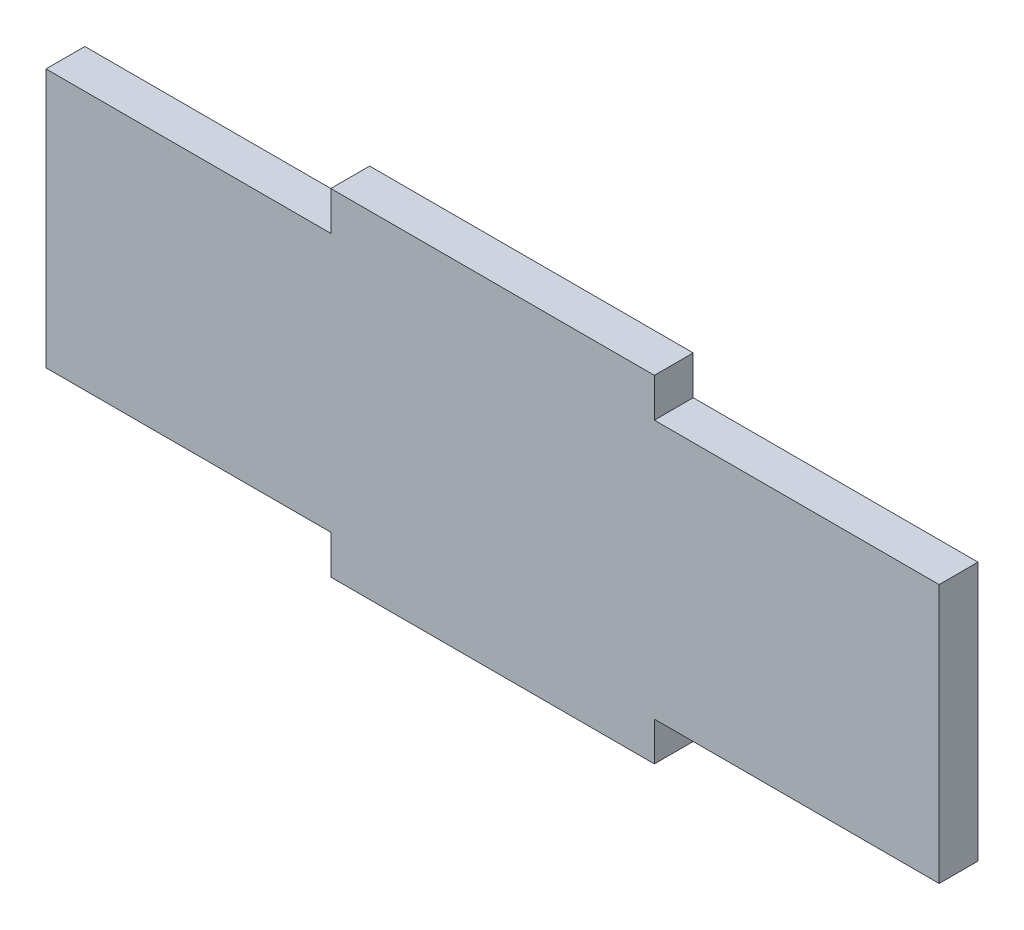
ISO-10303-21;
HEADER;
FILE_DESCRIPTION(('STEP AP214'),'2;1');
FILE_NAME('part.step','',(''),(''),'','','');
FILE_SCHEMA(('AUTOMOTIVE_DESIGN { 1 0 10303 214 1 1 1 1 }'));
ENDSEC;
DATA;
#1=APPLICATION_CONTEXT('core data for automotive mechanical design processes');
#2=APPLICATION_PROTOCOL_DEFINITION('international standard','automotive_design',2000,#1);
#3=PRODUCT_CONTEXT('',#1,'mechanical');
#4=PRODUCT('Part','Part','',(#3));
#5=PRODUCT_RELATED_PRODUCT_CATEGORY('part','',(#4));
#6=PRODUCT_DEFINITION_FORMATION('','',#4);
#7=PRODUCT_DEFINITION_CONTEXT('part definition',#1,'design');
#8=PRODUCT_DEFINITION('design','',#6,#7);
#9=PRODUCT_DEFINITION_SHAPE('','',#8);
#10=(LENGTH_UNIT() NAMED_UNIT(*) SI_UNIT(.MILLI.,.METRE.));
#11=(NAMED_UNIT(*) PLANE_ANGLE_UNIT() SI_UNIT($,.RADIAN.));
#12=(NAMED_UNIT(*) SI_UNIT($,.STERADIAN.) SOLID_ANGLE_UNIT());
#13=UNCERTAINTY_MEASURE_WITH_UNIT(LENGTH_MEASURE(1.E-05),#10,'distance_accuracy_value','');
#14=(GEOMETRIC_REPRESENTATION_CONTEXT(3) GLOBAL_UNCERTAINTY_ASSIGNED_CONTEXT((#13)) GLOBAL_UNIT_ASSIGNED_CONTEXT((#10,
#11,#12)) REPRESENTATION_CONTEXT('',''));
#15=CARTESIAN_POINT('',(0.,0.,0.));
#16=DIRECTION('',(0.,0.,1.));
#17=DIRECTION('',(1.,0.,0.));
#18=AXIS2_PLACEMENT_3D('',#15,#16,#17);
#19=CARTESIAN_POINT('',(69.,-20.,6.));
#20=DIRECTION('',(0.,1.,0.));
#21=DIRECTION('',(-1.,0.,0.));
#22=AXIS2_PLACEMENT_3D('',#19,#20,#21);
#23=PLANE('',#22);
#24=DIRECTION('',(0.,0.,1.));
#25=VECTOR('',#24,1.);
#26=CARTESIAN_POINT('',(25.,-20.,0.));
#27=LINE('',#26,#25);
#28=CARTESIAN_POINT('',(25.,-20.,0.));
#29=VERTEX_POINT('',#28);
#30=CARTESIAN_POINT('',(25.,-20.,6.));
#31=VERTEX_POINT('',#30);
#32=EDGE_CURVE('E154',#29,#31,#27,.T.);
#33=ORIENTED_EDGE('',*,*,#32,.F.);
#34=DIRECTION('',(1.,0.,0.));
#35=VECTOR('',#34,1.);
#36=CARTESIAN_POINT('',(69.,-20.,0.));
#37=LINE('',#36,#35);
#38=CARTESIAN_POINT('',(69.,-20.,0.));
#39=VERTEX_POINT('',#38);
#40=EDGE_CURVE('E197',#29,#39,#37,.T.);
#41=ORIENTED_EDGE('',*,*,#40,.T.);
#42=DIRECTION('',(0.,0.,-1.));
#43=VECTOR('',#42,1.);
#44=CARTESIAN_POINT('',(69.,-20.,6.));
#45=LINE('',#44,#43);
#46=CARTESIAN_POINT('',(69.,-20.,6.));
#47=VERTEX_POINT('',#46);
#48=EDGE_CURVE('E42',#47,#39,#45,.T.);
#49=ORIENTED_EDGE('',*,*,#48,.F.);
#50=DIRECTION('',(1.,0.,0.));
#51=VECTOR('',#50,1.);
#52=CARTESIAN_POINT('',(69.,-20.,6.));
#53=LINE('',#52,#51);
#54=EDGE_CURVE('E183',#31,#47,#53,.T.);
#55=ORIENTED_EDGE('',*,*,#54,.F.);
#56=EDGE_LOOP('',(#33,#41,#49,#55));
#57=FACE_BOUND('',#56,.T.);
#58=ADVANCED_FACE('F34',(#57),#23,.F.);
#59=CARTESIAN_POINT('',(69.,20.,6.));
#60=DIRECTION('',(0.,-1.,0.));
#61=DIRECTION('',(1.,0.,0.));
#62=AXIS2_PLACEMENT_3D('',#59,#60,#61);
#63=PLANE('',#62);
#64=DIRECTION('',(0.,0.,1.));
#65=VECTOR('',#64,1.);
#66=CARTESIAN_POINT('',(-25.,20.,0.));
#67=LINE('',#66,#65);
#68=CARTESIAN_POINT('',(-25.,20.,0.));
#69=VERTEX_POINT('',#68);
#70=CARTESIAN_POINT('',(-25.,20.,6.));
#71=VERTEX_POINT('',#70);
#72=EDGE_CURVE('E166',#69,#71,#67,.T.);
#73=ORIENTED_EDGE('',*,*,#72,.F.);
#74=DIRECTION('',(-1.,0.,0.));
#75=VECTOR('',#74,1.);
#76=CARTESIAN_POINT('',(69.,20.,0.));
#77=LINE('',#76,#75);
#78=CARTESIAN_POINT('',(-69.,20.,0.));
#79=VERTEX_POINT('',#78);
#80=EDGE_CURVE('E202',#69,#79,#77,.T.);
#81=ORIENTED_EDGE('',*,*,#80,.T.);
#82=DIRECTION('',(0.,0.,-1.));
#83=VECTOR('',#82,1.);
#84=CARTESIAN_POINT('',(-69.,20.,6.));
#85=LINE('',#84,#83);
#86=CARTESIAN_POINT('',(-69.,20.,6.));
#87=VERTEX_POINT('',#86);
#88=EDGE_CURVE('E194',#87,#79,#85,.T.);
#89=ORIENTED_EDGE('',*,*,#88,.F.);
#90=DIRECTION('',(-1.,0.,0.));
#91=VECTOR('',#90,1.);
#92=CARTESIAN_POINT('',(69.,20.,6.));
#93=LINE('',#92,#91);
#94=EDGE_CURVE('E190',#71,#87,#93,.T.);
#95=ORIENTED_EDGE('',*,*,#94,.F.);
#96=EDGE_LOOP('',(#73,#81,#89,#95));
#97=FACE_BOUND('',#96,.T.);
#98=ADVANCED_FACE('F242',(#97),#63,.F.);
#99=CARTESIAN_POINT('',(-69.,20.,6.));
#100=DIRECTION('',(1.,0.,0.));
#101=DIRECTION('',(0.,0.,-1.));
#102=AXIS2_PLACEMENT_3D('',#99,#100,#101);
#103=PLANE('',#102);
#104=DIRECTION('',(0.,-1.,0.));
#105=VECTOR('',#104,1.);
#106=CARTESIAN_POINT('',(-69.,20.,0.));
#107=LINE('',#106,#105);
#108=CARTESIAN_POINT('',(-69.,-20.,0.));
#109=VERTEX_POINT('',#108);
#110=EDGE_CURVE('E174',#79,#109,#107,.T.);
#111=ORIENTED_EDGE('',*,*,#110,.T.);
#112=DIRECTION('',(0.,0.,-1.));
#113=VECTOR('',#112,1.);
#114=CARTESIAN_POINT('',(-69.,-20.,6.));
#115=LINE('',#114,#113);
#116=CARTESIAN_POINT('',(-69.,-20.,6.));
#117=VERTEX_POINT('',#116);
#118=EDGE_CURVE('E11',#117,#109,#115,.T.);
#119=ORIENTED_EDGE('',*,*,#118,.F.);
#120=DIRECTION('',(0.,-1.,0.));
#121=VECTOR('',#120,1.);
#122=CARTESIAN_POINT('',(-69.,20.,6.));
#123=LINE('',#122,#121);
#124=EDGE_CURVE('E180',#87,#117,#123,.T.);
#125=ORIENTED_EDGE('',*,*,#124,.F.);
#126=ORIENTED_EDGE('',*,*,#88,.T.);
#127=EDGE_LOOP('',(#111,#119,#125,#126));
#128=FACE_BOUND('',#127,.T.);
#129=ADVANCED_FACE('F36',(#128),#103,.F.);
#130=CARTESIAN_POINT('',(-25.,-20.,0.));
#131=VERTEX_POINT('',#130);
#132=EDGE_CURVE('E198',#109,#131,#37,.T.);
#133=ORIENTED_EDGE('',*,*,#132,.T.);
#134=DIRECTION('',(0.,0.,1.));
#135=VECTOR('',#134,1.);
#136=CARTESIAN_POINT('',(-25.,-20.,0.));
#137=LINE('',#136,#135);
#138=CARTESIAN_POINT('',(-25.,-20.,6.));
#139=VERTEX_POINT('',#138);
#140=EDGE_CURVE('E143',#131,#139,#137,.T.);
#141=ORIENTED_EDGE('',*,*,#140,.T.);
#142=EDGE_CURVE('E185',#117,#139,#53,.T.);
#143=ORIENTED_EDGE('',*,*,#142,.F.);
#144=ORIENTED_EDGE('',*,*,#118,.T.);
#145=EDGE_LOOP('',(#133,#141,#143,#144));
#146=FACE_BOUND('',#145,.T.);
#147=ADVANCED_FACE('F234',(#146),#23,.F.);
#148=CARTESIAN_POINT('',(69.,20.,6.));
#149=DIRECTION('',(-1.,0.,0.));
#150=DIRECTION('',(0.,0.,1.));
#151=AXIS2_PLACEMENT_3D('',#148,#149,#150);
#152=PLANE('',#151);
#153=DIRECTION('',(0.,1.,0.));
#154=VECTOR('',#153,1.);
#155=CARTESIAN_POINT('',(69.,20.,0.));
#156=LINE('',#155,#154);
#157=CARTESIAN_POINT('',(69.,20.,0.));
#158=VERTEX_POINT('',#157);
#159=EDGE_CURVE('E200',#39,#158,#156,.T.);
#160=ORIENTED_EDGE('',*,*,#159,.T.);
#161=DIRECTION('',(0.,0.,-1.));
#162=VECTOR('',#161,1.);
#163=CARTESIAN_POINT('',(69.,20.,6.));
#164=LINE('',#163,#162);
#165=CARTESIAN_POINT('',(69.,20.,6.));
#166=VERTEX_POINT('',#165);
#167=EDGE_CURVE('E207',#166,#158,#164,.T.);
#168=ORIENTED_EDGE('',*,*,#167,.F.);
#169=DIRECTION('',(0.,1.,0.));
#170=VECTOR('',#169,1.);
#171=CARTESIAN_POINT('',(69.,20.,6.));
#172=LINE('',#171,#170);
#173=EDGE_CURVE('E188',#47,#166,#172,.T.);
#174=ORIENTED_EDGE('',*,*,#173,.F.);
#175=ORIENTED_EDGE('',*,*,#48,.T.);
#176=EDGE_LOOP('',(#160,#168,#174,#175));
#177=FACE_BOUND('',#176,.T.);
#178=ADVANCED_FACE('F214',(#177),#152,.F.);
#179=CARTESIAN_POINT('',(25.,20.,0.));
#180=VERTEX_POINT('',#179);
#181=EDGE_CURVE('E184',#158,#180,#77,.T.);
#182=ORIENTED_EDGE('',*,*,#181,.T.);
#183=DIRECTION('',(0.,0.,1.));
#184=VECTOR('',#183,1.);
#185=CARTESIAN_POINT('',(25.,20.,0.));
#186=LINE('',#185,#184);
#187=CARTESIAN_POINT('',(25.,20.,6.));
#188=VERTEX_POINT('',#187);
#189=EDGE_CURVE('E177',#180,#188,#186,.T.);
#190=ORIENTED_EDGE('',*,*,#189,.T.);
#191=EDGE_CURVE('E191',#166,#188,#93,.T.);
#192=ORIENTED_EDGE('',*,*,#191,.F.);
#193=ORIENTED_EDGE('',*,*,#167,.T.);
#194=EDGE_LOOP('',(#182,#190,#192,#193));
#195=FACE_BOUND('',#194,.T.);
#196=ADVANCED_FACE('F222',(#195),#63,.F.);
#197=CARTESIAN_POINT('',(0.,0.,6.));
#198=DIRECTION('',(0.,0.,-1.));
#199=DIRECTION('',(-1.,0.,0.));
#200=AXIS2_PLACEMENT_3D('',#197,#198,#199);
#201=PLANE('',#200);
#202=ORIENTED_EDGE('',*,*,#124,.T.);
#203=ORIENTED_EDGE('',*,*,#142,.T.);
#204=DIRECTION('',(0.,-1.,0.));
#205=VECTOR('',#204,1.);
#206=CARTESIAN_POINT('',(-25.,-20.,6.));
#207=LINE('',#206,#205);
#208=CARTESIAN_POINT('',(-25.,-26.,6.));
#209=VERTEX_POINT('',#208);
#210=EDGE_CURVE('E49',#139,#209,#207,.T.);
#211=ORIENTED_EDGE('',*,*,#210,.T.);
#212=DIRECTION('',(1.,0.,0.));
#213=VECTOR('',#212,1.);
#214=CARTESIAN_POINT('',(-25.,-26.,6.));
#215=LINE('',#214,#213);
#216=CARTESIAN_POINT('',(25.,-26.,6.));
#217=VERTEX_POINT('',#216);
#218=EDGE_CURVE('E128',#209,#217,#215,.T.);
#219=ORIENTED_EDGE('',*,*,#218,.T.);
#220=DIRECTION('',(0.,1.,0.));
#221=VECTOR('',#220,1.);
#222=CARTESIAN_POINT('',(25.,-20.,6.));
#223=LINE('',#222,#221);
#224=EDGE_CURVE('E144',#217,#31,#223,.T.);
#225=ORIENTED_EDGE('',*,*,#224,.T.);
#226=ORIENTED_EDGE('',*,*,#54,.T.);
#227=ORIENTED_EDGE('',*,*,#173,.T.);
#228=ORIENTED_EDGE('',*,*,#191,.T.);
#229=DIRECTION('',(0.,1.,0.));
#230=VECTOR('',#229,1.);
#231=CARTESIAN_POINT('',(25.,20.,6.));
#232=LINE('',#231,#230);
#233=CARTESIAN_POINT('',(25.,26.,6.));
#234=VERTEX_POINT('',#233);
#235=EDGE_CURVE('E57',#188,#234,#232,.T.);
#236=ORIENTED_EDGE('',*,*,#235,.T.);
#237=DIRECTION('',(-1.,0.,0.));
#238=VECTOR('',#237,1.);
#239=CARTESIAN_POINT('',(-25.,26.,6.));
#240=LINE('',#239,#238);
#241=CARTESIAN_POINT('',(-25.,26.,6.));
#242=VERTEX_POINT('',#241);
#243=EDGE_CURVE('E160',#234,#242,#240,.T.);
#244=ORIENTED_EDGE('',*,*,#243,.T.);
#245=DIRECTION('',(0.,-1.,0.));
#246=VECTOR('',#245,1.);
#247=CARTESIAN_POINT('',(-25.,20.,6.));
#248=LINE('',#247,#246);
#249=EDGE_CURVE('E153',#242,#71,#248,.T.);
#250=ORIENTED_EDGE('',*,*,#249,.T.);
#251=ORIENTED_EDGE('',*,*,#94,.T.);
#252=EDGE_LOOP('',(#202,#203,#211,#219,#225,#226,#227,#228,#236,#244,#250,#251));
#253=FACE_BOUND('',#252,.T.);
#254=ADVANCED_FACE('F225',(#253),#201,.F.);
#255=CARTESIAN_POINT('',(0.,0.,0.));
#256=DIRECTION('',(0.,0.,-1.));
#257=DIRECTION('',(-1.,0.,0.));
#258=AXIS2_PLACEMENT_3D('',#255,#256,#257);
#259=PLANE('',#258);
#260=ORIENTED_EDGE('',*,*,#110,.F.);
#261=ORIENTED_EDGE('',*,*,#80,.F.);
#262=DIRECTION('',(0.,-1.,0.));
#263=VECTOR('',#262,1.);
#264=CARTESIAN_POINT('',(-25.,20.,0.));
#265=LINE('',#264,#263);
#266=CARTESIAN_POINT('',(-25.,26.,0.));
#267=VERTEX_POINT('',#266);
#268=EDGE_CURVE('E157',#267,#69,#265,.T.);
#269=ORIENTED_EDGE('',*,*,#268,.F.);
#270=DIRECTION('',(-1.,0.,0.));
#271=VECTOR('',#270,1.);
#272=CARTESIAN_POINT('',(-25.,26.,0.));
#273=LINE('',#272,#271);
#274=CARTESIAN_POINT('',(25.,26.,0.));
#275=VERTEX_POINT('',#274);
#276=EDGE_CURVE('E163',#275,#267,#273,.T.);
#277=ORIENTED_EDGE('',*,*,#276,.F.);
#278=DIRECTION('',(0.,1.,0.));
#279=VECTOR('',#278,1.);
#280=CARTESIAN_POINT('',(25.,20.,0.));
#281=LINE('',#280,#279);
#282=EDGE_CURVE('E159',#180,#275,#281,.T.);
#283=ORIENTED_EDGE('',*,*,#282,.F.);
#284=ORIENTED_EDGE('',*,*,#181,.F.);
#285=ORIENTED_EDGE('',*,*,#159,.F.);
#286=ORIENTED_EDGE('',*,*,#40,.F.);
#287=DIRECTION('',(0.,1.,0.));
#288=VECTOR('',#287,1.);
#289=CARTESIAN_POINT('',(25.,-20.,0.));
#290=LINE('',#289,#288);
#291=CARTESIAN_POINT('',(25.,-26.,0.));
#292=VERTEX_POINT('',#291);
#293=EDGE_CURVE('E131',#292,#29,#290,.T.);
#294=ORIENTED_EDGE('',*,*,#293,.F.);
#295=DIRECTION('',(1.,0.,0.));
#296=VECTOR('',#295,1.);
#297=CARTESIAN_POINT('',(-25.,-26.,0.));
#298=LINE('',#297,#296);
#299=CARTESIAN_POINT('',(-25.,-26.,0.));
#300=VERTEX_POINT('',#299);
#301=EDGE_CURVE('E126',#300,#292,#298,.T.);
#302=ORIENTED_EDGE('',*,*,#301,.F.);
#303=DIRECTION('',(0.,-1.,0.));
#304=VECTOR('',#303,1.);
#305=CARTESIAN_POINT('',(-25.,-20.,0.));
#306=LINE('',#305,#304);
#307=EDGE_CURVE('E138',#131,#300,#306,.T.);
#308=ORIENTED_EDGE('',*,*,#307,.F.);
#309=ORIENTED_EDGE('',*,*,#132,.F.);
#310=EDGE_LOOP('',(#260,#261,#269,#277,#283,#284,#285,#286,#294,#302,#308,#309));
#311=FACE_BOUND('',#310,.T.);
#312=ADVANCED_FACE('F137',(#311),#259,.T.);
#313=CARTESIAN_POINT('',(-25.,20.,0.));
#314=DIRECTION('',(-1.,0.,0.));
#315=DIRECTION('',(0.,0.,1.));
#316=AXIS2_PLACEMENT_3D('',#313,#314,#315);
#317=PLANE('',#316);
#318=ORIENTED_EDGE('',*,*,#249,.F.);
#319=DIRECTION('',(0.,0.,1.));
#320=VECTOR('',#319,1.);
#321=CARTESIAN_POINT('',(-25.,26.,0.));
#322=LINE('',#321,#320);
#323=EDGE_CURVE('E172',#267,#242,#322,.T.);
#324=ORIENTED_EDGE('',*,*,#323,.F.);
#325=ORIENTED_EDGE('',*,*,#268,.T.);
#326=ORIENTED_EDGE('',*,*,#72,.T.);
#327=EDGE_LOOP('',(#318,#324,#325,#326));
#328=FACE_BOUND('',#327,.T.);
#329=ADVANCED_FACE('F245',(#328),#317,.T.);
#330=CARTESIAN_POINT('',(-25.,26.,0.));
#331=DIRECTION('',(0.,1.,0.));
#332=DIRECTION('',(0.,0.,1.));
#333=AXIS2_PLACEMENT_3D('',#330,#331,#332);
#334=PLANE('',#333);
#335=ORIENTED_EDGE('',*,*,#243,.F.);
#336=DIRECTION('',(0.,0.,1.));
#337=VECTOR('',#336,1.);
#338=CARTESIAN_POINT('',(25.,26.,0.));
#339=LINE('',#338,#337);
#340=EDGE_CURVE('E175',#275,#234,#339,.T.);
#341=ORIENTED_EDGE('',*,*,#340,.F.);
#342=ORIENTED_EDGE('',*,*,#276,.T.);
#343=ORIENTED_EDGE('',*,*,#323,.T.);
#344=EDGE_LOOP('',(#335,#341,#342,#343));
#345=FACE_BOUND('',#344,.T.);
#346=ADVANCED_FACE('F247',(#345),#334,.T.);
#347=CARTESIAN_POINT('',(25.,20.,0.));
#348=DIRECTION('',(1.,0.,0.));
#349=DIRECTION('',(0.,0.,-1.));
#350=AXIS2_PLACEMENT_3D('',#347,#348,#349);
#351=PLANE('',#350);
#352=ORIENTED_EDGE('',*,*,#235,.F.);
#353=ORIENTED_EDGE('',*,*,#189,.F.);
#354=ORIENTED_EDGE('',*,*,#282,.T.);
#355=ORIENTED_EDGE('',*,*,#340,.T.);
#356=EDGE_LOOP('',(#352,#353,#354,#355));
#357=FACE_BOUND('',#356,.T.);
#358=ADVANCED_FACE('F248',(#357),#351,.T.);
#359=CARTESIAN_POINT('',(-25.,-20.,0.));
#360=DIRECTION('',(-1.,0.,0.));
#361=DIRECTION('',(0.,0.,1.));
#362=AXIS2_PLACEMENT_3D('',#359,#360,#361);
#363=PLANE('',#362);
#364=ORIENTED_EDGE('',*,*,#210,.F.);
#365=ORIENTED_EDGE('',*,*,#140,.F.);
#366=ORIENTED_EDGE('',*,*,#307,.T.);
#367=DIRECTION('',(0.,0.,1.));
#368=VECTOR('',#367,1.);
#369=CARTESIAN_POINT('',(-25.,-26.,0.));
#370=LINE('',#369,#368);
#371=EDGE_CURVE('E123',#300,#209,#370,.T.);
#372=ORIENTED_EDGE('',*,*,#371,.T.);
#373=EDGE_LOOP('',(#364,#365,#366,#372));
#374=FACE_BOUND('',#373,.T.);
#375=ADVANCED_FACE('F142',(#374),#363,.T.);
#376=CARTESIAN_POINT('',(25.,-20.,0.));
#377=DIRECTION('',(1.,0.,0.));
#378=DIRECTION('',(0.,0.,-1.));
#379=AXIS2_PLACEMENT_3D('',#376,#377,#378);
#380=PLANE('',#379);
#381=ORIENTED_EDGE('',*,*,#224,.F.);
#382=DIRECTION('',(0.,0.,1.));
#383=VECTOR('',#382,1.);
#384=CARTESIAN_POINT('',(25.,-26.,0.));
#385=LINE('',#384,#383);
#386=EDGE_CURVE('E130',#292,#217,#385,.T.);
#387=ORIENTED_EDGE('',*,*,#386,.F.);
#388=ORIENTED_EDGE('',*,*,#293,.T.);
#389=ORIENTED_EDGE('',*,*,#32,.T.);
#390=EDGE_LOOP('',(#381,#387,#388,#389));
#391=FACE_BOUND('',#390,.T.);
#392=ADVANCED_FACE('F230',(#391),#380,.T.);
#393=CARTESIAN_POINT('',(-25.,-26.,0.));
#394=DIRECTION('',(0.,-1.,0.));
#395=DIRECTION('',(0.,0.,-1.));
#396=AXIS2_PLACEMENT_3D('',#393,#394,#395);
#397=PLANE('',#396);
#398=ORIENTED_EDGE('',*,*,#218,.F.);
#399=ORIENTED_EDGE('',*,*,#371,.F.);
#400=ORIENTED_EDGE('',*,*,#301,.T.);
#401=ORIENTED_EDGE('',*,*,#386,.T.);
#402=EDGE_LOOP('',(#398,#399,#400,#401));
#403=FACE_BOUND('',#402,.T.);
#404=ADVANCED_FACE('F125',(#403),#397,.T.);
#405=CLOSED_SHELL('',(#58,#98,#129,#147,#178,#196,#254,#312,#329,#346,#358,#375,#392,#404));
#406=MANIFOLD_SOLID_BREP('B2',#405);
#407=ADVANCED_BREP_SHAPE_REPRESENTATION('',(#18,#406),#14);
#408=SHAPE_DEFINITION_REPRESENTATION(#9,#407);
ENDSEC;
END-ISO-10303-21;
